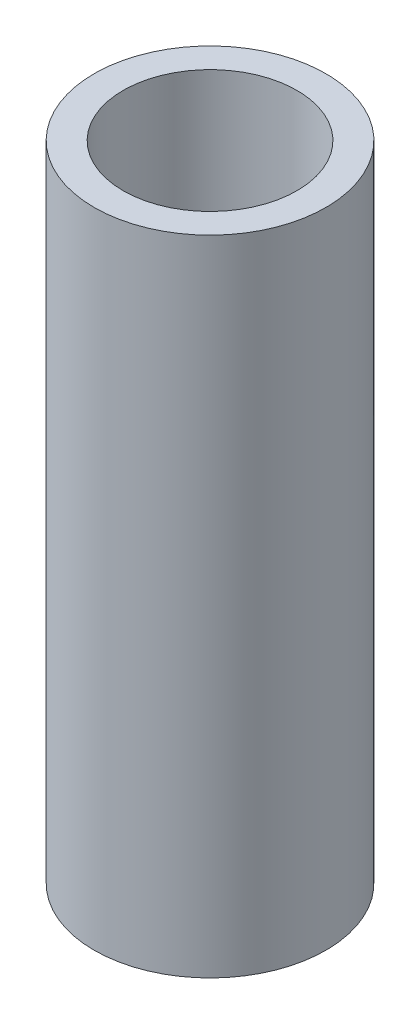
ISO-10303-21;
HEADER;
FILE_DESCRIPTION(('STEP AP214'),'2;1');
FILE_NAME('part.step','',(''),(''),'','','');
FILE_SCHEMA(('AUTOMOTIVE_DESIGN { 1 0 10303 214 1 1 1 1 }'));
ENDSEC;
DATA;
#1=APPLICATION_CONTEXT('core data for automotive mechanical design processes');
#2=APPLICATION_PROTOCOL_DEFINITION('international standard','automotive_design',2000,#1);
#3=PRODUCT_CONTEXT('',#1,'mechanical');
#4=PRODUCT('Part','Part','',(#3));
#5=PRODUCT_RELATED_PRODUCT_CATEGORY('part','',(#4));
#6=PRODUCT_DEFINITION_FORMATION('','',#4);
#7=PRODUCT_DEFINITION_CONTEXT('part definition',#1,'design');
#8=PRODUCT_DEFINITION('design','',#6,#7);
#9=PRODUCT_DEFINITION_SHAPE('','',#8);
#10=(LENGTH_UNIT() NAMED_UNIT(*) SI_UNIT(.MILLI.,.METRE.));
#11=(NAMED_UNIT(*) PLANE_ANGLE_UNIT() SI_UNIT($,.RADIAN.));
#12=(NAMED_UNIT(*) SI_UNIT($,.STERADIAN.) SOLID_ANGLE_UNIT());
#13=UNCERTAINTY_MEASURE_WITH_UNIT(LENGTH_MEASURE(1.E-05),#10,'distance_accuracy_value','');
#14=(GEOMETRIC_REPRESENTATION_CONTEXT(3) GLOBAL_UNCERTAINTY_ASSIGNED_CONTEXT((#13)) GLOBAL_UNIT_ASSIGNED_CONTEXT((#10,
#11,#12)) REPRESENTATION_CONTEXT('',''));
#15=CARTESIAN_POINT('',(0.,0.,0.));
#16=DIRECTION('',(0.,0.,1.));
#17=DIRECTION('',(1.,0.,0.));
#18=AXIS2_PLACEMENT_3D('',#15,#16,#17);
#19=CARTESIAN_POINT('',(0.,141.,0.));
#20=DIRECTION('',(0.,1.,0.));
#21=DIRECTION('',(0.,0.,1.));
#22=AXIS2_PLACEMENT_3D('',#19,#20,#21);
#23=PLANE('',#22);
#24=CARTESIAN_POINT('',(0.,141.,0.));
#25=DIRECTION('',(0.,1.,0.));
#26=DIRECTION('',(0.,0.,1.));
#27=AXIS2_PLACEMENT_3D('',#24,#25,#26);
#28=CIRCLE('',#27,25.4);
#29=CARTESIAN_POINT('',(0.,141.,25.4));
#30=VERTEX_POINT('',#29);
#31=EDGE_CURVE('E10',#30,#30,#28,.T.);
#32=ORIENTED_EDGE('',*,*,#31,.T.);
#33=EDGE_LOOP('',(#32));
#34=FACE_BOUND('',#33,.T.);
#35=CARTESIAN_POINT('',(0.,141.,0.));
#36=DIRECTION('',(0.,1.,0.));
#37=DIRECTION('',(0.,0.,1.));
#38=AXIS2_PLACEMENT_3D('',#35,#36,#37);
#39=CIRCLE('',#38,19.05);
#40=CARTESIAN_POINT('',(0.,141.,19.05));
#41=VERTEX_POINT('',#40);
#42=EDGE_CURVE('E43',#41,#41,#39,.T.);
#43=ORIENTED_EDGE('',*,*,#42,.F.);
#44=EDGE_LOOP('',(#43));
#45=FACE_BOUND('',#44,.T.);
#46=ADVANCED_FACE('F32',(#34,#45),#23,.T.);
#47=CARTESIAN_POINT('',(0.,0.,0.));
#48=DIRECTION('',(0.,1.,0.));
#49=DIRECTION('',(0.,0.,1.));
#50=AXIS2_PLACEMENT_3D('',#47,#48,#49);
#51=PLANE('',#50);
#52=CARTESIAN_POINT('',(0.,0.,0.));
#53=DIRECTION('',(0.,1.,0.));
#54=DIRECTION('',(0.,0.,1.));
#55=AXIS2_PLACEMENT_3D('',#52,#53,#54);
#56=CIRCLE('',#55,25.4);
#57=CARTESIAN_POINT('',(0.,0.,25.4));
#58=VERTEX_POINT('',#57);
#59=EDGE_CURVE('E36',#58,#58,#56,.T.);
#60=ORIENTED_EDGE('',*,*,#59,.F.);
#61=EDGE_LOOP('',(#60));
#62=FACE_BOUND('',#61,.T.);
#63=CARTESIAN_POINT('',(0.,0.,0.));
#64=DIRECTION('',(0.,1.,0.));
#65=DIRECTION('',(0.,0.,1.));
#66=AXIS2_PLACEMENT_3D('',#63,#64,#65);
#67=CIRCLE('',#66,19.05);
#68=CARTESIAN_POINT('',(0.,0.,19.05));
#69=VERTEX_POINT('',#68);
#70=EDGE_CURVE('E45',#69,#69,#67,.T.);
#71=ORIENTED_EDGE('',*,*,#70,.T.);
#72=EDGE_LOOP('',(#71));
#73=FACE_BOUND('',#72,.T.);
#74=ADVANCED_FACE('F55',(#62,#73),#51,.F.);
#75=CARTESIAN_POINT('',(0.,141.,0.));
#76=DIRECTION('',(0.,-1.,0.));
#77=DIRECTION('',(0.,0.,-1.));
#78=AXIS2_PLACEMENT_3D('',#75,#76,#77);
#79=CYLINDRICAL_SURFACE('',#78,25.4);
#80=ORIENTED_EDGE('',*,*,#31,.F.);
#81=EDGE_LOOP('',(#80));
#82=FACE_BOUND('',#81,.T.);
#83=ORIENTED_EDGE('',*,*,#59,.T.);
#84=EDGE_LOOP('',(#83));
#85=FACE_BOUND('',#84,.T.);
#86=ADVANCED_FACE('F34',(#82,#85),#79,.T.);
#87=CARTESIAN_POINT('',(0.,141.,0.));
#88=DIRECTION('',(0.,-1.,0.));
#89=DIRECTION('',(0.,0.,-1.));
#90=AXIS2_PLACEMENT_3D('',#87,#88,#89);
#91=CYLINDRICAL_SURFACE('',#90,19.05);
#92=ORIENTED_EDGE('',*,*,#42,.T.);
#93=EDGE_LOOP('',(#92));
#94=FACE_BOUND('',#93,.T.);
#95=ORIENTED_EDGE('',*,*,#70,.F.);
#96=EDGE_LOOP('',(#95));
#97=FACE_BOUND('',#96,.T.);
#98=ADVANCED_FACE('F51',(#94,#97),#91,.F.);
#99=CLOSED_SHELL('',(#46,#74,#86,#98));
#100=MANIFOLD_SOLID_BREP('B2',#99);
#101=ADVANCED_BREP_SHAPE_REPRESENTATION('',(#18,#100),#14);
#102=SHAPE_DEFINITION_REPRESENTATION(#9,#101);
ENDSEC;
END-ISO-10303-21;
